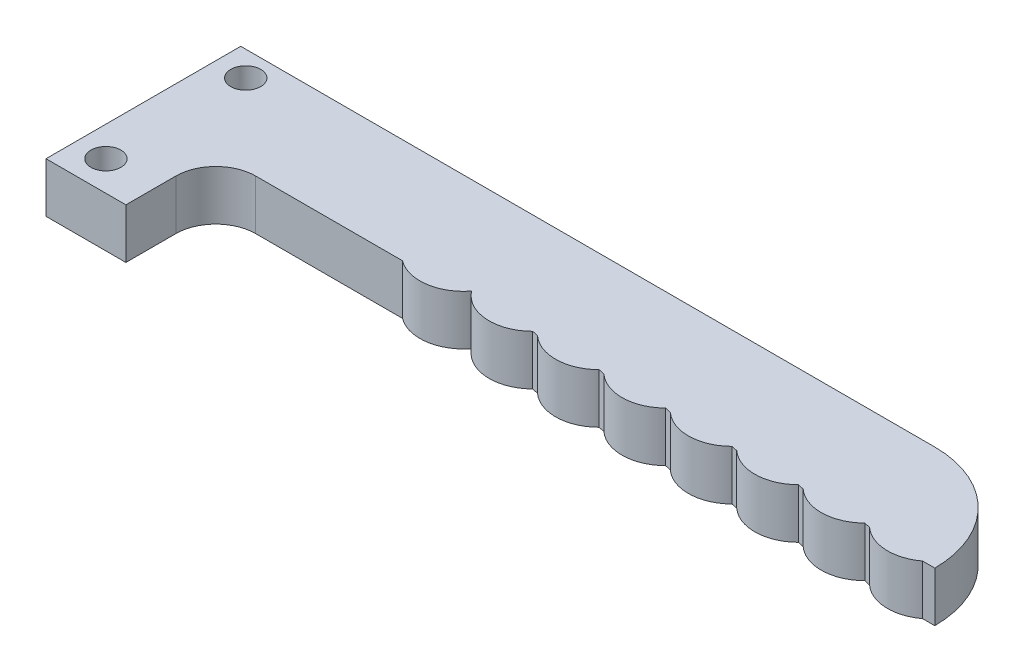
ISO-10303-21;
HEADER;
FILE_DESCRIPTION(('STEP AP214'),'2;1');
FILE_NAME('part.step','',(''),(''),'','','');
FILE_SCHEMA(('AUTOMOTIVE_DESIGN { 1 0 10303 214 1 1 1 1 }'));
ENDSEC;
DATA;
#1=APPLICATION_CONTEXT('core data for automotive mechanical design processes');
#2=APPLICATION_PROTOCOL_DEFINITION('international standard','automotive_design',2000,#1);
#3=PRODUCT_CONTEXT('',#1,'mechanical');
#4=PRODUCT('Part','Part','',(#3));
#5=PRODUCT_RELATED_PRODUCT_CATEGORY('part','',(#4));
#6=PRODUCT_DEFINITION_FORMATION('','',#4);
#7=PRODUCT_DEFINITION_CONTEXT('part definition',#1,'design');
#8=PRODUCT_DEFINITION('design','',#6,#7);
#9=PRODUCT_DEFINITION_SHAPE('','',#8);
#10=(LENGTH_UNIT() NAMED_UNIT(*) SI_UNIT(.MILLI.,.METRE.));
#11=(NAMED_UNIT(*) PLANE_ANGLE_UNIT() SI_UNIT($,.RADIAN.));
#12=(NAMED_UNIT(*) SI_UNIT($,.STERADIAN.) SOLID_ANGLE_UNIT());
#13=UNCERTAINTY_MEASURE_WITH_UNIT(LENGTH_MEASURE(1.E-05),#10,'distance_accuracy_value','');
#14=(GEOMETRIC_REPRESENTATION_CONTEXT(3) GLOBAL_UNCERTAINTY_ASSIGNED_CONTEXT((#13)) GLOBAL_UNIT_ASSIGNED_CONTEXT((#10,
#11,#12)) REPRESENTATION_CONTEXT('',''));
#15=CARTESIAN_POINT('',(0.,0.,0.));
#16=DIRECTION('',(0.,0.,1.));
#17=DIRECTION('',(1.,0.,0.));
#18=AXIS2_PLACEMENT_3D('',#15,#16,#17);
#19=CARTESIAN_POINT('',(-45.,5.,-0.875000000000003));
#20=DIRECTION('',(0.,0.,1.));
#21=DIRECTION('',(1.,0.,0.));
#22=AXIS2_PLACEMENT_3D('',#19,#20,#21);
#23=PLANE('',#22);
#24=DIRECTION('',(-1.,0.,0.));
#25=VECTOR('',#24,1.);
#26=CARTESIAN_POINT('',(-45.,5.,-0.875000000000003));
#27=LINE('',#26,#25);
#28=CARTESIAN_POINT('',(-18.3059854254778,5.,-0.874999999999996));
#29=VERTEX_POINT('',#28);
#30=CARTESIAN_POINT('',(-33.,5.,-0.875));
#31=VERTEX_POINT('',#30);
#32=EDGE_CURVE('E196',#29,#31,#27,.T.);
#33=ORIENTED_EDGE('',*,*,#32,.T.);
#34=DIRECTION('',(0.,1.,0.));
#35=VECTOR('',#34,1.);
#36=CARTESIAN_POINT('',(-33.,5.,-0.875));
#37=LINE('',#36,#35);
#38=CARTESIAN_POINT('',(-33.,0.,-0.875));
#39=VERTEX_POINT('',#38);
#40=EDGE_CURVE('E52',#31,#39,#37,.F.);
#41=ORIENTED_EDGE('',*,*,#40,.T.);
#42=DIRECTION('',(-1.,0.,0.));
#43=VECTOR('',#42,1.);
#44=CARTESIAN_POINT('',(-45.,0.,-0.875000000000003));
#45=LINE('',#44,#43);
#46=CARTESIAN_POINT('',(-18.3059854254778,0.,-0.874999999999996));
#47=VERTEX_POINT('',#46);
#48=EDGE_CURVE('E261',#47,#39,#45,.T.);
#49=ORIENTED_EDGE('',*,*,#48,.F.);
#50=DIRECTION('',(0.,-1.,0.));
#51=VECTOR('',#50,1.);
#52=CARTESIAN_POINT('',(-18.3059854254778,5.,-0.874999999999996));
#53=LINE('',#52,#51);
#54=EDGE_CURVE('E258',#29,#47,#53,.T.);
#55=ORIENTED_EDGE('',*,*,#54,.F.);
#56=EDGE_LOOP('',(#33,#41,#49,#55));
#57=FACE_BOUND('',#56,.T.);
#58=ADVANCED_FACE('F35',(#57),#23,.T.);
#59=CARTESIAN_POINT('',(-15.6809854254778,5.,-4.37500000000001));
#60=DIRECTION('',(0.,-1.,0.));
#61=DIRECTION('',(0.,0.,-1.));
#62=AXIS2_PLACEMENT_3D('',#59,#60,#61);
#63=CYLINDRICAL_SURFACE('',#62,4.37500000000001);
#64=CARTESIAN_POINT('',(-15.6809854254778,0.,-4.37500000000001));
#65=DIRECTION('',(0.,-1.,0.));
#66=DIRECTION('',(0.,0.,-1.));
#67=AXIS2_PLACEMENT_3D('',#64,#65,#66);
#68=CIRCLE('',#67,4.37500000000001);
#69=CARTESIAN_POINT('',(-12.2154927127389,0.,-1.70460953080757));
#70=VERTEX_POINT('',#69);
#71=EDGE_CURVE('E225',#70,#47,#68,.T.);
#72=ORIENTED_EDGE('',*,*,#71,.F.);
#73=DIRECTION('',(0.,-1.,0.));
#74=VECTOR('',#73,1.);
#75=CARTESIAN_POINT('',(-12.2154927127389,5.,-1.70460953080757));
#76=LINE('',#75,#74);
#77=CARTESIAN_POINT('',(-12.2154927127389,5.,-1.70460953080757));
#78=VERTEX_POINT('',#77);
#79=EDGE_CURVE('E292',#78,#70,#76,.T.);
#80=ORIENTED_EDGE('',*,*,#79,.F.);
#81=CARTESIAN_POINT('',(-15.6809854254778,5.,-4.37500000000001));
#82=DIRECTION('',(0.,-1.,0.));
#83=DIRECTION('',(0.,0.,-1.));
#84=AXIS2_PLACEMENT_3D('',#81,#82,#83);
#85=CIRCLE('',#84,4.37500000000001);
#86=EDGE_CURVE('E226',#78,#29,#85,.T.);
#87=ORIENTED_EDGE('',*,*,#86,.T.);
#88=ORIENTED_EDGE('',*,*,#54,.T.);
#89=EDGE_LOOP('',(#72,#80,#87,#88));
#90=FACE_BOUND('',#89,.T.);
#91=ADVANCED_FACE('F389',(#90),#63,.T.);
#92=CARTESIAN_POINT('',(-8.75000000000001,5.,-4.37500000000001));
#93=DIRECTION('',(0.,-1.,0.));
#94=DIRECTION('',(0.,0.,-1.));
#95=AXIS2_PLACEMENT_3D('',#92,#93,#94);
#96=CYLINDRICAL_SURFACE('',#95,4.375);
#97=CARTESIAN_POINT('',(-8.75000000000001,0.,-4.37500000000001));
#98=DIRECTION('',(0.,-1.,0.));
#99=DIRECTION('',(0.,0.,-1.));
#100=AXIS2_PLACEMENT_3D('',#97,#98,#99);
#101=CIRCLE('',#100,4.375);
#102=CARTESIAN_POINT('',(-5.66092195289418,0.,-1.27690028906608));
#103=VERTEX_POINT('',#102);
#104=EDGE_CURVE('E229',#103,#70,#101,.T.);
#105=ORIENTED_EDGE('',*,*,#104,.F.);
#106=DIRECTION('',(0.,-1.,0.));
#107=VECTOR('',#106,1.);
#108=CARTESIAN_POINT('',(-5.66092195289418,5.,-1.27690028906608));
#109=LINE('',#108,#107);
#110=CARTESIAN_POINT('',(-5.66092195289418,5.,-1.27690028906608));
#111=VERTEX_POINT('',#110);
#112=EDGE_CURVE('E332',#103,#111,#109,.F.);
#113=ORIENTED_EDGE('',*,*,#112,.T.);
#114=CARTESIAN_POINT('',(-8.75000000000001,5.,-4.37500000000001));
#115=DIRECTION('',(0.,-1.,0.));
#116=DIRECTION('',(0.,0.,-1.));
#117=AXIS2_PLACEMENT_3D('',#114,#115,#116);
#118=CIRCLE('',#117,4.375);
#119=EDGE_CURVE('E256',#111,#78,#118,.T.);
#120=ORIENTED_EDGE('',*,*,#119,.T.);
#121=ORIENTED_EDGE('',*,*,#79,.T.);
#122=EDGE_LOOP('',(#105,#113,#120,#121));
#123=FACE_BOUND('',#122,.T.);
#124=ADVANCED_FACE('F394',(#123),#96,.T.);
#125=CARTESIAN_POINT('',(-2.10000000000001,5.,-4.37500000000001));
#126=DIRECTION('',(0.,-1.,0.));
#127=DIRECTION('',(0.,0.,-1.));
#128=AXIS2_PLACEMENT_3D('',#125,#126,#127);
#129=CYLINDRICAL_SURFACE('',#128,4.37500000000001);
#130=CARTESIAN_POINT('',(-2.10000000000001,0.,-4.37500000000001));
#131=DIRECTION('',(0.,-1.,0.));
#132=DIRECTION('',(0.,0.,-1.));
#133=AXIS2_PLACEMENT_3D('',#130,#131,#132);
#134=CIRCLE('',#133,4.37500000000001);
#135=CARTESIAN_POINT('',(0.989078047105822,0.,-1.27690028906608));
#136=VERTEX_POINT('',#135);
#137=CARTESIAN_POINT('',(-5.0445002260906,0.,-1.13917809226891));
#138=VERTEX_POINT('',#137);
#139=EDGE_CURVE('E288',#136,#138,#134,.T.);
#140=ORIENTED_EDGE('',*,*,#139,.F.);
#141=DIRECTION('',(0.,-1.,0.));
#142=VECTOR('',#141,1.);
#143=CARTESIAN_POINT('',(0.989078047105822,5.,-1.27690028906608));
#144=LINE('',#143,#142);
#145=CARTESIAN_POINT('',(0.989078047105822,5.,-1.27690028906608));
#146=VERTEX_POINT('',#145);
#147=EDGE_CURVE('E322',#136,#146,#144,.F.);
#148=ORIENTED_EDGE('',*,*,#147,.T.);
#149=CARTESIAN_POINT('',(-2.10000000000001,5.,-4.37500000000001));
#150=DIRECTION('',(0.,-1.,0.));
#151=DIRECTION('',(0.,0.,-1.));
#152=AXIS2_PLACEMENT_3D('',#149,#150,#151);
#153=CIRCLE('',#152,4.37500000000001);
#154=CARTESIAN_POINT('',(-5.0445002260906,5.,-1.13917809226891));
#155=VERTEX_POINT('',#154);
#156=EDGE_CURVE('E253',#146,#155,#153,.T.);
#157=ORIENTED_EDGE('',*,*,#156,.T.);
#158=DIRECTION('',(0.,-1.,0.));
#159=VECTOR('',#158,1.);
#160=CARTESIAN_POINT('',(-5.0445002260906,5.,-1.13917809226891));
#161=LINE('',#160,#159);
#162=EDGE_CURVE('E319',#155,#138,#161,.T.);
#163=ORIENTED_EDGE('',*,*,#162,.T.);
#164=EDGE_LOOP('',(#140,#148,#157,#163));
#165=FACE_BOUND('',#164,.T.);
#166=ADVANCED_FACE('F608',(#165),#129,.T.);
#167=CARTESIAN_POINT('',(4.54999999999999,5.,-4.37500000000001));
#168=DIRECTION('',(0.,-1.,0.));
#169=DIRECTION('',(0.,0.,-1.));
#170=AXIS2_PLACEMENT_3D('',#167,#168,#169);
#171=CYLINDRICAL_SURFACE('',#170,4.37500000000001);
#172=CARTESIAN_POINT('',(4.54999999999999,5.,-4.37500000000001));
#173=DIRECTION('',(0.,-1.,0.));
#174=DIRECTION('',(0.,0.,-1.));
#175=AXIS2_PLACEMENT_3D('',#172,#173,#174);
#176=CIRCLE('',#175,4.37500000000001);
#177=CARTESIAN_POINT('',(7.63907804710582,5.,-1.27690028906608));
#178=VERTEX_POINT('',#177);
#179=CARTESIAN_POINT('',(1.6054997739094,5.,-1.13917809226891));
#180=VERTEX_POINT('',#179);
#181=EDGE_CURVE('E250',#178,#180,#176,.T.);
#182=ORIENTED_EDGE('',*,*,#181,.T.);
#183=DIRECTION('',(0.,-1.,0.));
#184=VECTOR('',#183,1.);
#185=CARTESIAN_POINT('',(1.6054997739094,5.,-1.13917809226891));
#186=LINE('',#185,#184);
#187=CARTESIAN_POINT('',(1.6054997739094,0.,-1.13917809226891));
#188=VERTEX_POINT('',#187);
#189=EDGE_CURVE('E316',#180,#188,#186,.T.);
#190=ORIENTED_EDGE('',*,*,#189,.T.);
#191=CARTESIAN_POINT('',(4.54999999999999,0.,-4.37500000000001));
#192=DIRECTION('',(0.,-1.,0.));
#193=DIRECTION('',(0.,0.,-1.));
#194=AXIS2_PLACEMENT_3D('',#191,#192,#193);
#195=CIRCLE('',#194,4.37500000000001);
#196=CARTESIAN_POINT('',(7.63907804710582,0.,-1.27690028906608));
#197=VERTEX_POINT('',#196);
#198=EDGE_CURVE('E285',#197,#188,#195,.T.);
#199=ORIENTED_EDGE('',*,*,#198,.F.);
#200=DIRECTION('',(0.,-1.,0.));
#201=VECTOR('',#200,1.);
#202=CARTESIAN_POINT('',(7.63907804710582,5.,-1.27690028906608));
#203=LINE('',#202,#201);
#204=EDGE_CURVE('E314',#197,#178,#203,.F.);
#205=ORIENTED_EDGE('',*,*,#204,.T.);
#206=EDGE_LOOP('',(#182,#190,#199,#205));
#207=FACE_BOUND('',#206,.T.);
#208=ADVANCED_FACE('F615',(#207),#171,.T.);
#209=CARTESIAN_POINT('',(11.2,5.,-4.37500000000001));
#210=DIRECTION('',(0.,-1.,0.));
#211=DIRECTION('',(0.,0.,-1.));
#212=AXIS2_PLACEMENT_3D('',#209,#210,#211);
#213=CYLINDRICAL_SURFACE('',#212,4.37500000000001);
#214=CARTESIAN_POINT('',(11.2,5.,-4.37500000000001));
#215=DIRECTION('',(0.,-1.,0.));
#216=DIRECTION('',(0.,0.,-1.));
#217=AXIS2_PLACEMENT_3D('',#214,#215,#216);
#218=CIRCLE('',#217,4.37500000000001);
#219=CARTESIAN_POINT('',(14.2890780471058,5.,-1.27690028906607));
#220=VERTEX_POINT('',#219);
#221=CARTESIAN_POINT('',(8.25549977390939,5.,-1.13917809226892));
#222=VERTEX_POINT('',#221);
#223=EDGE_CURVE('E247',#220,#222,#218,.T.);
#224=ORIENTED_EDGE('',*,*,#223,.T.);
#225=DIRECTION('',(0.,-1.,0.));
#226=VECTOR('',#225,1.);
#227=CARTESIAN_POINT('',(8.25549977390939,5.,-1.13917809226892));
#228=LINE('',#227,#226);
#229=CARTESIAN_POINT('',(8.25549977390939,0.,-1.13917809226892));
#230=VERTEX_POINT('',#229);
#231=EDGE_CURVE('E329',#222,#230,#228,.T.);
#232=ORIENTED_EDGE('',*,*,#231,.T.);
#233=CARTESIAN_POINT('',(11.2,0.,-4.37500000000001));
#234=DIRECTION('',(0.,-1.,0.));
#235=DIRECTION('',(0.,0.,-1.));
#236=AXIS2_PLACEMENT_3D('',#233,#234,#235);
#237=CIRCLE('',#236,4.37500000000001);
#238=CARTESIAN_POINT('',(14.2890780471058,0.,-1.27690028906607));
#239=VERTEX_POINT('',#238);
#240=EDGE_CURVE('E282',#239,#230,#237,.T.);
#241=ORIENTED_EDGE('',*,*,#240,.F.);
#242=DIRECTION('',(0.,-1.,0.));
#243=VECTOR('',#242,1.);
#244=CARTESIAN_POINT('',(14.2890780471058,5.,-1.27690028906607));
#245=LINE('',#244,#243);
#246=EDGE_CURVE('E327',#239,#220,#245,.F.);
#247=ORIENTED_EDGE('',*,*,#246,.T.);
#248=EDGE_LOOP('',(#224,#232,#241,#247));
#249=FACE_BOUND('',#248,.T.);
#250=ADVANCED_FACE('F623',(#249),#213,.T.);
#251=CARTESIAN_POINT('',(17.85,5.,-4.37500000000001));
#252=DIRECTION('',(0.,-1.,0.));
#253=DIRECTION('',(0.,0.,-1.));
#254=AXIS2_PLACEMENT_3D('',#251,#252,#253);
#255=CYLINDRICAL_SURFACE('',#254,4.37500000000001);
#256=CARTESIAN_POINT('',(17.85,0.,-4.37500000000001));
#257=DIRECTION('',(0.,-1.,0.));
#258=DIRECTION('',(0.,0.,-1.));
#259=AXIS2_PLACEMENT_3D('',#256,#257,#258);
#260=CIRCLE('',#259,4.37500000000001);
#261=CARTESIAN_POINT('',(20.9390780471058,0.,-1.27690028906607));
#262=VERTEX_POINT('',#261);
#263=CARTESIAN_POINT('',(14.9054997739094,0.,-1.13917809226891));
#264=VERTEX_POINT('',#263);
#265=EDGE_CURVE('E279',#262,#264,#260,.T.);
#266=ORIENTED_EDGE('',*,*,#265,.F.);
#267=DIRECTION('',(0.,-1.,0.));
#268=VECTOR('',#267,1.);
#269=CARTESIAN_POINT('',(20.9390780471058,5.,-1.27690028906607));
#270=LINE('',#269,#268);
#271=CARTESIAN_POINT('',(20.9390780471058,5.,-1.27690028906607));
#272=VERTEX_POINT('',#271);
#273=EDGE_CURVE('E312',#262,#272,#270,.F.);
#274=ORIENTED_EDGE('',*,*,#273,.T.);
#275=CARTESIAN_POINT('',(17.85,5.,-4.37500000000001));
#276=DIRECTION('',(0.,-1.,0.));
#277=DIRECTION('',(0.,0.,-1.));
#278=AXIS2_PLACEMENT_3D('',#275,#276,#277);
#279=CIRCLE('',#278,4.37500000000001);
#280=CARTESIAN_POINT('',(14.9054997739094,5.,-1.13917809226891));
#281=VERTEX_POINT('',#280);
#282=EDGE_CURVE('E244',#272,#281,#279,.T.);
#283=ORIENTED_EDGE('',*,*,#282,.T.);
#284=DIRECTION('',(0.,-1.,0.));
#285=VECTOR('',#284,1.);
#286=CARTESIAN_POINT('',(14.9054997739094,5.,-1.13917809226891));
#287=LINE('',#286,#285);
#288=EDGE_CURVE('E309',#281,#264,#287,.T.);
#289=ORIENTED_EDGE('',*,*,#288,.T.);
#290=EDGE_LOOP('',(#266,#274,#283,#289));
#291=FACE_BOUND('',#290,.T.);
#292=ADVANCED_FACE('F451',(#291),#255,.T.);
#293=CARTESIAN_POINT('',(24.5,5.,-4.37500000000001));
#294=DIRECTION('',(0.,-1.,0.));
#295=DIRECTION('',(0.,0.,-1.));
#296=AXIS2_PLACEMENT_3D('',#293,#294,#295);
#297=CYLINDRICAL_SURFACE('',#296,4.37500000000001);
#298=CARTESIAN_POINT('',(24.5,5.,-4.37500000000001));
#299=DIRECTION('',(0.,-1.,0.));
#300=DIRECTION('',(0.,0.,-1.));
#301=AXIS2_PLACEMENT_3D('',#298,#299,#300);
#302=CIRCLE('',#301,4.37500000000001);
#303=CARTESIAN_POINT('',(27.5890780471058,5.,-1.27690028906607));
#304=VERTEX_POINT('',#303);
#305=CARTESIAN_POINT('',(21.5554997739094,5.,-1.1391780922689));
#306=VERTEX_POINT('',#305);
#307=EDGE_CURVE('E241',#304,#306,#302,.T.);
#308=ORIENTED_EDGE('',*,*,#307,.T.);
#309=DIRECTION('',(0.,-1.,0.));
#310=VECTOR('',#309,1.);
#311=CARTESIAN_POINT('',(21.5554997739094,5.,-1.1391780922689));
#312=LINE('',#311,#310);
#313=CARTESIAN_POINT('',(21.5554997739094,0.,-1.1391780922689));
#314=VERTEX_POINT('',#313);
#315=EDGE_CURVE('E306',#306,#314,#312,.T.);
#316=ORIENTED_EDGE('',*,*,#315,.T.);
#317=CARTESIAN_POINT('',(24.5,0.,-4.37500000000001));
#318=DIRECTION('',(0.,-1.,0.));
#319=DIRECTION('',(0.,0.,-1.));
#320=AXIS2_PLACEMENT_3D('',#317,#318,#319);
#321=CIRCLE('',#320,4.37500000000001);
#322=CARTESIAN_POINT('',(27.5890780471058,0.,-1.27690028906607));
#323=VERTEX_POINT('',#322);
#324=EDGE_CURVE('E276',#323,#314,#321,.T.);
#325=ORIENTED_EDGE('',*,*,#324,.F.);
#326=DIRECTION('',(0.,-1.,0.));
#327=VECTOR('',#326,1.);
#328=CARTESIAN_POINT('',(27.5890780471058,5.,-1.27690028906607));
#329=LINE('',#328,#327);
#330=EDGE_CURVE('E295',#323,#304,#329,.F.);
#331=ORIENTED_EDGE('',*,*,#330,.T.);
#332=EDGE_LOOP('',(#308,#316,#325,#331));
#333=FACE_BOUND('',#332,.T.);
#334=ADVANCED_FACE('F457',(#333),#297,.T.);
#335=CARTESIAN_POINT('',(31.15,5.,-4.37500000000001));
#336=DIRECTION('',(0.,-1.,0.));
#337=DIRECTION('',(0.,0.,-1.));
#338=AXIS2_PLACEMENT_3D('',#335,#336,#337);
#339=CYLINDRICAL_SURFACE('',#338,4.375);
#340=CARTESIAN_POINT('',(31.15,5.,-4.37500000000001));
#341=DIRECTION('',(0.,-1.,0.));
#342=DIRECTION('',(0.,0.,-1.));
#343=AXIS2_PLACEMENT_3D('',#340,#341,#342);
#344=CIRCLE('',#343,4.375);
#345=CARTESIAN_POINT('',(33.775,5.,-0.875000000000004));
#346=VERTEX_POINT('',#345);
#347=CARTESIAN_POINT('',(28.2054997739094,5.,-1.13917809226891));
#348=VERTEX_POINT('',#347);
#349=EDGE_CURVE('E238',#346,#348,#344,.T.);
#350=ORIENTED_EDGE('',*,*,#349,.T.);
#351=DIRECTION('',(0.,-1.,0.));
#352=VECTOR('',#351,1.);
#353=CARTESIAN_POINT('',(28.2054997739094,5.,-1.13917809226891));
#354=LINE('',#353,#352);
#355=CARTESIAN_POINT('',(28.2054997739094,0.,-1.13917809226891));
#356=VERTEX_POINT('',#355);
#357=EDGE_CURVE('E324',#348,#356,#354,.T.);
#358=ORIENTED_EDGE('',*,*,#357,.T.);
#359=CARTESIAN_POINT('',(31.15,0.,-4.37500000000001));
#360=DIRECTION('',(0.,-1.,0.));
#361=DIRECTION('',(0.,0.,-1.));
#362=AXIS2_PLACEMENT_3D('',#359,#360,#361);
#363=CIRCLE('',#362,4.375);
#364=CARTESIAN_POINT('',(33.775,0.,-0.875000000000004));
#365=VERTEX_POINT('',#364);
#366=EDGE_CURVE('E273',#365,#356,#363,.T.);
#367=ORIENTED_EDGE('',*,*,#366,.F.);
#368=DIRECTION('',(0.,-1.,0.));
#369=VECTOR('',#368,1.);
#370=CARTESIAN_POINT('',(33.775,5.,-0.875000000000004));
#371=LINE('',#370,#369);
#372=EDGE_CURVE('E296',#346,#365,#371,.T.);
#373=ORIENTED_EDGE('',*,*,#372,.F.);
#374=EDGE_LOOP('',(#350,#358,#367,#373));
#375=FACE_BOUND('',#374,.T.);
#376=ADVANCED_FACE('F464',(#375),#339,.T.);
#377=CARTESIAN_POINT('',(35.,5.,-0.875000000000005));
#378=DIRECTION('',(0.,0.,1.));
#379=DIRECTION('',(1.,0.,0.));
#380=AXIS2_PLACEMENT_3D('',#377,#378,#379);
#381=PLANE('',#380);
#382=DIRECTION('',(-1.,0.,0.));
#383=VECTOR('',#382,1.);
#384=CARTESIAN_POINT('',(35.,0.,-0.875000000000005));
#385=LINE('',#384,#383);
#386=CARTESIAN_POINT('',(35.,0.,-0.875000000000005));
#387=VERTEX_POINT('',#386);
#388=EDGE_CURVE('E270',#387,#365,#385,.T.);
#389=ORIENTED_EDGE('',*,*,#388,.F.);
#390=DIRECTION('',(0.,-1.,0.));
#391=VECTOR('',#390,1.);
#392=CARTESIAN_POINT('',(35.,5.,-0.875000000000005));
#393=LINE('',#392,#391);
#394=CARTESIAN_POINT('',(35.,5.,-0.875000000000005));
#395=VERTEX_POINT('',#394);
#396=EDGE_CURVE('E298',#395,#387,#393,.T.);
#397=ORIENTED_EDGE('',*,*,#396,.F.);
#398=DIRECTION('',(-1.,0.,0.));
#399=VECTOR('',#398,1.);
#400=CARTESIAN_POINT('',(35.,5.,-0.875000000000005));
#401=LINE('',#400,#399);
#402=EDGE_CURVE('E235',#395,#346,#401,.T.);
#403=ORIENTED_EDGE('',*,*,#402,.T.);
#404=ORIENTED_EDGE('',*,*,#372,.T.);
#405=EDGE_LOOP('',(#389,#397,#403,#404));
#406=FACE_BOUND('',#405,.T.);
#407=ADVANCED_FACE('F468',(#406),#381,.T.);
#408=CARTESIAN_POINT('',(24.5,5.,-0.875000000000003));
#409=DIRECTION('',(0.,-1.,0.));
#410=DIRECTION('',(0.,0.,-1.));
#411=AXIS2_PLACEMENT_3D('',#408,#409,#410);
#412=CYLINDRICAL_SURFACE('',#411,10.5);
#413=CARTESIAN_POINT('',(24.5,0.,-0.875000000000003));
#414=DIRECTION('',(0.,-1.,0.));
#415=DIRECTION('',(0.,0.,-1.));
#416=AXIS2_PLACEMENT_3D('',#413,#414,#415);
#417=CIRCLE('',#416,10.5);
#418=CARTESIAN_POINT('',(24.5,0.,-11.375));
#419=VERTEX_POINT('',#418);
#420=EDGE_CURVE('E267',#419,#387,#417,.T.);
#421=ORIENTED_EDGE('',*,*,#420,.F.);
#422=DIRECTION('',(0.,-1.,0.));
#423=VECTOR('',#422,1.);
#424=CARTESIAN_POINT('',(24.5,5.,-11.375));
#425=LINE('',#424,#423);
#426=CARTESIAN_POINT('',(24.5,5.,-11.375));
#427=VERTEX_POINT('',#426);
#428=EDGE_CURVE('E300',#427,#419,#425,.T.);
#429=ORIENTED_EDGE('',*,*,#428,.F.);
#430=CARTESIAN_POINT('',(24.5,5.,-0.875000000000003));
#431=DIRECTION('',(0.,-1.,0.));
#432=DIRECTION('',(0.,0.,-1.));
#433=AXIS2_PLACEMENT_3D('',#430,#431,#432);
#434=CIRCLE('',#433,10.5);
#435=EDGE_CURVE('E232',#427,#395,#434,.T.);
#436=ORIENTED_EDGE('',*,*,#435,.T.);
#437=ORIENTED_EDGE('',*,*,#396,.T.);
#438=EDGE_LOOP('',(#421,#429,#436,#437));
#439=FACE_BOUND('',#438,.T.);
#440=ADVANCED_FACE('F471',(#439),#412,.T.);
#441=CARTESIAN_POINT('',(-45.,5.,-11.375));
#442=DIRECTION('',(0.,0.,-1.));
#443=DIRECTION('',(-1.,0.,0.));
#444=AXIS2_PLACEMENT_3D('',#441,#442,#443);
#445=PLANE('',#444);
#446=DIRECTION('',(1.,0.,0.));
#447=VECTOR('',#446,1.);
#448=CARTESIAN_POINT('',(-45.,0.,-11.375));
#449=LINE('',#448,#447);
#450=CARTESIAN_POINT('',(-45.,0.,-11.375));
#451=VERTEX_POINT('',#450);
#452=EDGE_CURVE('E264',#451,#419,#449,.T.);
#453=ORIENTED_EDGE('',*,*,#452,.F.);
#454=DIRECTION('',(0.,-1.,0.));
#455=VECTOR('',#454,1.);
#456=CARTESIAN_POINT('',(-45.,5.,-11.375));
#457=LINE('',#456,#455);
#458=CARTESIAN_POINT('',(-45.,5.,-11.375));
#459=VERTEX_POINT('',#458);
#460=EDGE_CURVE('E302',#459,#451,#457,.T.);
#461=ORIENTED_EDGE('',*,*,#460,.F.);
#462=DIRECTION('',(1.,0.,0.));
#463=VECTOR('',#462,1.);
#464=CARTESIAN_POINT('',(-45.,5.,-11.375));
#465=LINE('',#464,#463);
#466=EDGE_CURVE('E194',#459,#427,#465,.T.);
#467=ORIENTED_EDGE('',*,*,#466,.T.);
#468=ORIENTED_EDGE('',*,*,#428,.T.);
#469=EDGE_LOOP('',(#453,#461,#467,#468));
#470=FACE_BOUND('',#469,.T.);
#471=ADVANCED_FACE('F385',(#470),#445,.T.);
#472=CARTESIAN_POINT('',(-45.,5.,-0.875000000000003));
#473=DIRECTION('',(-1.,0.,0.));
#474=DIRECTION('',(0.,0.,1.));
#475=AXIS2_PLACEMENT_3D('',#472,#473,#474);
#476=PLANE('',#475);
#477=DIRECTION('',(0.,0.,-1.));
#478=VECTOR('',#477,1.);
#479=CARTESIAN_POINT('',(-45.,0.,-0.875000000000003));
#480=LINE('',#479,#478);
#481=CARTESIAN_POINT('',(-45.,0.,8.12500000000001));
#482=VERTEX_POINT('',#481);
#483=EDGE_CURVE('E202',#482,#451,#480,.T.);
#484=ORIENTED_EDGE('',*,*,#483,.F.);
#485=DIRECTION('',(0.,-1.,0.));
#486=VECTOR('',#485,1.);
#487=CARTESIAN_POINT('',(-45.,0.,8.12500000000001));
#488=LINE('',#487,#486);
#489=CARTESIAN_POINT('',(-45.,5.,8.12500000000001));
#490=VERTEX_POINT('',#489);
#491=EDGE_CURVE('E199',#490,#482,#488,.T.);
#492=ORIENTED_EDGE('',*,*,#491,.F.);
#493=DIRECTION('',(0.,0.,-1.));
#494=VECTOR('',#493,1.);
#495=CARTESIAN_POINT('',(-45.,5.,-0.875000000000003));
#496=LINE('',#495,#494);
#497=EDGE_CURVE('E186',#490,#459,#496,.T.);
#498=ORIENTED_EDGE('',*,*,#497,.T.);
#499=ORIENTED_EDGE('',*,*,#460,.T.);
#500=EDGE_LOOP('',(#484,#492,#498,#499));
#501=FACE_BOUND('',#500,.T.);
#502=ADVANCED_FACE('F200',(#501),#476,.T.);
#503=CARTESIAN_POINT('',(-15.6809854254778,5.,-4.37500000000001));
#504=DIRECTION('',(0.,-1.,0.));
#505=DIRECTION('',(0.,0.,-1.));
#506=AXIS2_PLACEMENT_3D('',#503,#504,#505);
#507=PLANE('',#506);
#508=CARTESIAN_POINT('',(-42.,5.,5.125));
#509=DIRECTION('',(0.,1.,0.));
#510=DIRECTION('',(0.,0.,1.));
#511=AXIS2_PLACEMENT_3D('',#508,#509,#510);
#512=CIRCLE('',#511,1.5);
#513=CARTESIAN_POINT('',(-42.,5.,6.62500000000001));
#514=VERTEX_POINT('',#513);
#515=EDGE_CURVE('E363',#514,#514,#512,.T.);
#516=ORIENTED_EDGE('',*,*,#515,.F.);
#517=EDGE_LOOP('',(#516));
#518=FACE_BOUND('',#517,.T.);
#519=CARTESIAN_POINT('',(-42.,5.,-8.875));
#520=DIRECTION('',(0.,1.,0.));
#521=DIRECTION('',(0.,0.,1.));
#522=AXIS2_PLACEMENT_3D('',#519,#520,#521);
#523=CIRCLE('',#522,1.5);
#524=CARTESIAN_POINT('',(-42.,5.,-7.37499999999999));
#525=VERTEX_POINT('',#524);
#526=EDGE_CURVE('E215',#525,#525,#523,.T.);
#527=ORIENTED_EDGE('',*,*,#526,.F.);
#528=EDGE_LOOP('',(#527));
#529=FACE_BOUND('',#528,.T.);
#530=ORIENTED_EDGE('',*,*,#86,.F.);
#531=ORIENTED_EDGE('',*,*,#119,.F.);
#532=DIRECTION('',(-0.975938457896702,0.,-0.218046156577472));
#533=VECTOR('',#532,1.);
#534=CARTESIAN_POINT('',(-15.863864732791,5.,-3.55646253086048));
#535=LINE('',#534,#533);
#536=EDGE_CURVE('E352',#111,#155,#535,.F.);
#537=ORIENTED_EDGE('',*,*,#536,.T.);
#538=ORIENTED_EDGE('',*,*,#156,.F.);
#539=DIRECTION('',(-0.975938457896701,0.,-0.218046156577477));
#540=VECTOR('',#539,1.);
#541=CARTESIAN_POINT('',(-15.5476962922429,5.,-4.97158006903403));
#542=LINE('',#541,#540);
#543=EDGE_CURVE('E340',#146,#180,#542,.F.);
#544=ORIENTED_EDGE('',*,*,#543,.T.);
#545=ORIENTED_EDGE('',*,*,#181,.F.);
#546=DIRECTION('',(-0.975938457896703,0.,-0.218046156577466));
#547=VECTOR('',#546,1.);
#548=CARTESIAN_POINT('',(-15.2315278516949,5.,-6.38669760720726));
#549=LINE('',#548,#547);
#550=EDGE_CURVE('E348',#178,#222,#549,.F.);
#551=ORIENTED_EDGE('',*,*,#550,.T.);
#552=ORIENTED_EDGE('',*,*,#223,.F.);
#553=DIRECTION('',(-0.975938457896703,0.,-0.218046156577469));
#554=VECTOR('',#553,1.);
#555=CARTESIAN_POINT('',(-14.9153594111468,5.,-7.80181514538076));
#556=LINE('',#555,#554);
#557=EDGE_CURVE('E356',#220,#281,#556,.F.);
#558=ORIENTED_EDGE('',*,*,#557,.T.);
#559=ORIENTED_EDGE('',*,*,#282,.F.);
#560=DIRECTION('',(-0.975938457896701,0.,-0.218046156577477));
#561=VECTOR('',#560,1.);
#562=CARTESIAN_POINT('',(-14.5991909705986,5.,-9.2169326835545));
#563=LINE('',#562,#561);
#564=EDGE_CURVE('E336',#272,#306,#563,.F.);
#565=ORIENTED_EDGE('',*,*,#564,.T.);
#566=ORIENTED_EDGE('',*,*,#307,.F.);
#567=DIRECTION('',(-0.975938457896704,0.,-0.218046156577465));
#568=VECTOR('',#567,1.);
#569=CARTESIAN_POINT('',(-14.2830225300507,5.,-10.6320502217275));
#570=LINE('',#569,#568);
#571=EDGE_CURVE('E344',#304,#348,#570,.F.);
#572=ORIENTED_EDGE('',*,*,#571,.T.);
#573=ORIENTED_EDGE('',*,*,#349,.F.);
#574=ORIENTED_EDGE('',*,*,#402,.F.);
#575=ORIENTED_EDGE('',*,*,#435,.F.);
#576=ORIENTED_EDGE('',*,*,#466,.F.);
#577=ORIENTED_EDGE('',*,*,#497,.F.);
#578=DIRECTION('',(-1.,0.,0.));
#579=VECTOR('',#578,1.);
#580=CARTESIAN_POINT('',(-45.,5.,8.12500000000001));
#581=LINE('',#580,#579);
#582=CARTESIAN_POINT('',(-37.,5.,8.12500000000001));
#583=VERTEX_POINT('',#582);
#584=EDGE_CURVE('E191',#583,#490,#581,.T.);
#585=ORIENTED_EDGE('',*,*,#584,.F.);
#586=DIRECTION('',(0.,0.,-1.));
#587=VECTOR('',#586,1.);
#588=CARTESIAN_POINT('',(-37.,5.,8.12500000000001));
#589=LINE('',#588,#587);
#590=CARTESIAN_POINT('',(-37.,5.,3.125));
#591=VERTEX_POINT('',#590);
#592=EDGE_CURVE('E220',#583,#591,#589,.T.);
#593=ORIENTED_EDGE('',*,*,#592,.T.);
#594=CARTESIAN_POINT('',(-33.,5.,3.125));
#595=DIRECTION('',(0.,-1.,0.));
#596=DIRECTION('',(0.,0.,-1.));
#597=AXIS2_PLACEMENT_3D('',#594,#595,#596);
#598=CIRCLE('',#597,4.);
#599=EDGE_CURVE('E44',#591,#31,#598,.T.);
#600=ORIENTED_EDGE('',*,*,#599,.T.);
#601=ORIENTED_EDGE('',*,*,#32,.F.);
#602=EDGE_LOOP('',(#530,#531,#537,#538,#544,#545,#551,#552,#558,#559,#565,#566,#572,#573,#574,
#575,#576,#577,#585,#593,#600,#601));
#603=FACE_BOUND('',#602,.T.);
#604=ADVANCED_FACE('F189',(#518,#529,#603),#507,.F.);
#605=CARTESIAN_POINT('',(-15.6809854254778,0.,-4.37500000000001));
#606=DIRECTION('',(0.,-1.,0.));
#607=DIRECTION('',(0.,0.,-1.));
#608=AXIS2_PLACEMENT_3D('',#605,#606,#607);
#609=PLANE('',#608);
#610=CARTESIAN_POINT('',(-42.,0.,5.125));
#611=DIRECTION('',(0.,-1.,0.));
#612=DIRECTION('',(0.,0.,-1.));
#613=AXIS2_PLACEMENT_3D('',#610,#611,#612);
#614=CIRCLE('',#613,1.5);
#615=CARTESIAN_POINT('',(-42.,0.,3.625));
#616=VERTEX_POINT('',#615);
#617=EDGE_CURVE('E39',#616,#616,#614,.T.);
#618=ORIENTED_EDGE('',*,*,#617,.F.);
#619=EDGE_LOOP('',(#618));
#620=FACE_BOUND('',#619,.T.);
#621=CARTESIAN_POINT('',(-42.,0.,-8.875));
#622=DIRECTION('',(0.,-1.,0.));
#623=DIRECTION('',(0.,0.,-1.));
#624=AXIS2_PLACEMENT_3D('',#621,#622,#623);
#625=CIRCLE('',#624,1.5);
#626=CARTESIAN_POINT('',(-42.,0.,-10.375));
#627=VERTEX_POINT('',#626);
#628=EDGE_CURVE('E213',#627,#627,#625,.T.);
#629=ORIENTED_EDGE('',*,*,#628,.F.);
#630=EDGE_LOOP('',(#629));
#631=FACE_BOUND('',#630,.T.);
#632=ORIENTED_EDGE('',*,*,#71,.T.);
#633=ORIENTED_EDGE('',*,*,#48,.T.);
#634=CARTESIAN_POINT('',(-33.,0.,3.125));
#635=DIRECTION('',(0.,-1.,0.));
#636=DIRECTION('',(0.,0.,-1.));
#637=AXIS2_PLACEMENT_3D('',#634,#635,#636);
#638=CIRCLE('',#637,4.);
#639=CARTESIAN_POINT('',(-37.,0.,3.125));
#640=VERTEX_POINT('',#639);
#641=EDGE_CURVE('E11',#39,#640,#638,.F.);
#642=ORIENTED_EDGE('',*,*,#641,.T.);
#643=DIRECTION('',(0.,0.,-1.));
#644=VECTOR('',#643,1.);
#645=CARTESIAN_POINT('',(-37.,0.,8.12500000000001));
#646=LINE('',#645,#644);
#647=CARTESIAN_POINT('',(-37.,0.,8.12500000000001));
#648=VERTEX_POINT('',#647);
#649=EDGE_CURVE('E222',#648,#640,#646,.T.);
#650=ORIENTED_EDGE('',*,*,#649,.F.);
#651=DIRECTION('',(1.,0.,0.));
#652=VECTOR('',#651,1.);
#653=CARTESIAN_POINT('',(-37.,0.,8.12500000000001));
#654=LINE('',#653,#652);
#655=EDGE_CURVE('E205',#482,#648,#654,.T.);
#656=ORIENTED_EDGE('',*,*,#655,.F.);
#657=ORIENTED_EDGE('',*,*,#483,.T.);
#658=ORIENTED_EDGE('',*,*,#452,.T.);
#659=ORIENTED_EDGE('',*,*,#420,.T.);
#660=ORIENTED_EDGE('',*,*,#388,.T.);
#661=ORIENTED_EDGE('',*,*,#366,.T.);
#662=DIRECTION('',(0.975938457896704,0.,0.218046156577465));
#663=VECTOR('',#662,1.);
#664=CARTESIAN_POINT('',(28.2054997739094,0.,-1.13917809226891));
#665=LINE('',#664,#663);
#666=EDGE_CURVE('E342',#356,#323,#665,.F.);
#667=ORIENTED_EDGE('',*,*,#666,.T.);
#668=ORIENTED_EDGE('',*,*,#324,.T.);
#669=DIRECTION('',(0.975938457896701,0.,0.218046156577477));
#670=VECTOR('',#669,1.);
#671=CARTESIAN_POINT('',(21.5554997739094,0.,-1.1391780922689));
#672=LINE('',#671,#670);
#673=EDGE_CURVE('E334',#314,#262,#672,.F.);
#674=ORIENTED_EDGE('',*,*,#673,.T.);
#675=ORIENTED_EDGE('',*,*,#265,.T.);
#676=DIRECTION('',(0.975938457896703,0.,0.218046156577469));
#677=VECTOR('',#676,1.);
#678=CARTESIAN_POINT('',(14.9054997739094,0.,-1.13917809226891));
#679=LINE('',#678,#677);
#680=EDGE_CURVE('E354',#264,#239,#679,.F.);
#681=ORIENTED_EDGE('',*,*,#680,.T.);
#682=ORIENTED_EDGE('',*,*,#240,.T.);
#683=DIRECTION('',(0.975938457896703,0.,0.218046156577466));
#684=VECTOR('',#683,1.);
#685=CARTESIAN_POINT('',(8.25549977390939,0.,-1.13917809226892));
#686=LINE('',#685,#684);
#687=EDGE_CURVE('E346',#230,#197,#686,.F.);
#688=ORIENTED_EDGE('',*,*,#687,.T.);
#689=ORIENTED_EDGE('',*,*,#198,.T.);
#690=DIRECTION('',(0.975938457896701,0.,0.218046156577477));
#691=VECTOR('',#690,1.);
#692=CARTESIAN_POINT('',(1.6054997739094,0.,-1.13917809226891));
#693=LINE('',#692,#691);
#694=EDGE_CURVE('E338',#188,#136,#693,.F.);
#695=ORIENTED_EDGE('',*,*,#694,.T.);
#696=ORIENTED_EDGE('',*,*,#139,.T.);
#697=DIRECTION('',(0.975938457896702,0.,0.218046156577472));
#698=VECTOR('',#697,1.);
#699=CARTESIAN_POINT('',(-5.0445002260906,0.,-1.13917809226891));
#700=LINE('',#699,#698);
#701=EDGE_CURVE('E350',#138,#103,#700,.F.);
#702=ORIENTED_EDGE('',*,*,#701,.T.);
#703=ORIENTED_EDGE('',*,*,#104,.T.);
#704=EDGE_LOOP('',(#632,#633,#642,#650,#656,#657,#658,#659,#660,#661,#667,#668,#674,#675,#681,
#682,#688,#689,#695,#696,#702,#703));
#705=FACE_BOUND('',#704,.T.);
#706=ADVANCED_FACE('F375',(#620,#631,#705),#609,.T.);
#707=CARTESIAN_POINT('',(-37.,5.,8.12500000000001));
#708=DIRECTION('',(-1.,0.,0.));
#709=DIRECTION('',(0.,0.,1.));
#710=AXIS2_PLACEMENT_3D('',#707,#708,#709);
#711=PLANE('',#710);
#712=ORIENTED_EDGE('',*,*,#649,.T.);
#713=DIRECTION('',(0.,1.,0.));
#714=VECTOR('',#713,1.);
#715=CARTESIAN_POINT('',(-37.,5.,3.125));
#716=LINE('',#715,#714);
#717=EDGE_CURVE('E358',#640,#591,#716,.T.);
#718=ORIENTED_EDGE('',*,*,#717,.T.);
#719=ORIENTED_EDGE('',*,*,#592,.F.);
#720=DIRECTION('',(0.,1.,0.));
#721=VECTOR('',#720,1.);
#722=CARTESIAN_POINT('',(-37.,5.,8.12500000000001));
#723=LINE('',#722,#721);
#724=EDGE_CURVE('E209',#648,#583,#723,.T.);
#725=ORIENTED_EDGE('',*,*,#724,.F.);
#726=EDGE_LOOP('',(#712,#718,#719,#725));
#727=FACE_BOUND('',#726,.T.);
#728=ADVANCED_FACE('F382',(#727),#711,.F.);
#729=CARTESIAN_POINT('',(0.,0.,8.12500000000001));
#730=DIRECTION('',(0.,0.,-1.));
#731=DIRECTION('',(-1.,0.,0.));
#732=AXIS2_PLACEMENT_3D('',#729,#730,#731);
#733=PLANE('',#732);
#734=ORIENTED_EDGE('',*,*,#584,.T.);
#735=ORIENTED_EDGE('',*,*,#491,.T.);
#736=ORIENTED_EDGE('',*,*,#655,.T.);
#737=ORIENTED_EDGE('',*,*,#724,.T.);
#738=EDGE_LOOP('',(#734,#735,#736,#737));
#739=FACE_BOUND('',#738,.T.);
#740=ADVANCED_FACE('F207',(#739),#733,.F.);
#741=CARTESIAN_POINT('',(21.5554997739094,5.,-1.1391780922689));
#742=DIRECTION('',(-0.218046156577477,0.,0.975938457896701));
#743=DIRECTION('',(0.,1.,0.));
#744=AXIS2_PLACEMENT_3D('',#741,#742,#743);
#745=PLANE('',#744);
#746=ORIENTED_EDGE('',*,*,#564,.F.);
#747=ORIENTED_EDGE('',*,*,#273,.F.);
#748=ORIENTED_EDGE('',*,*,#673,.F.);
#749=ORIENTED_EDGE('',*,*,#315,.F.);
#750=EDGE_LOOP('',(#746,#747,#748,#749));
#751=FACE_BOUND('',#750,.T.);
#752=ADVANCED_FACE('F400',(#751),#745,.T.);
#753=CARTESIAN_POINT('',(1.6054997739094,5.,-1.13917809226891));
#754=DIRECTION('',(-0.218046156577477,0.,0.975938457896701));
#755=DIRECTION('',(0.,1.,0.));
#756=AXIS2_PLACEMENT_3D('',#753,#754,#755);
#757=PLANE('',#756);
#758=ORIENTED_EDGE('',*,*,#543,.F.);
#759=ORIENTED_EDGE('',*,*,#147,.F.);
#760=ORIENTED_EDGE('',*,*,#694,.F.);
#761=ORIENTED_EDGE('',*,*,#189,.F.);
#762=EDGE_LOOP('',(#758,#759,#760,#761));
#763=FACE_BOUND('',#762,.T.);
#764=ADVANCED_FACE('F406',(#763),#757,.T.);
#765=CARTESIAN_POINT('',(28.2054997739094,5.,-1.13917809226891));
#766=DIRECTION('',(-0.218046156577465,0.,0.975938457896703));
#767=DIRECTION('',(0.,1.,0.));
#768=AXIS2_PLACEMENT_3D('',#765,#766,#767);
#769=PLANE('',#768);
#770=ORIENTED_EDGE('',*,*,#571,.F.);
#771=ORIENTED_EDGE('',*,*,#330,.F.);
#772=ORIENTED_EDGE('',*,*,#666,.F.);
#773=ORIENTED_EDGE('',*,*,#357,.F.);
#774=EDGE_LOOP('',(#770,#771,#772,#773));
#775=FACE_BOUND('',#774,.T.);
#776=ADVANCED_FACE('F413',(#775),#769,.T.);
#777=CARTESIAN_POINT('',(8.25549977390939,5.,-1.13917809226892));
#778=DIRECTION('',(-0.218046156577466,0.,0.975938457896703));
#779=DIRECTION('',(0.,1.,0.));
#780=AXIS2_PLACEMENT_3D('',#777,#778,#779);
#781=PLANE('',#780);
#782=ORIENTED_EDGE('',*,*,#550,.F.);
#783=ORIENTED_EDGE('',*,*,#204,.F.);
#784=ORIENTED_EDGE('',*,*,#687,.F.);
#785=ORIENTED_EDGE('',*,*,#231,.F.);
#786=EDGE_LOOP('',(#782,#783,#784,#785));
#787=FACE_BOUND('',#786,.T.);
#788=ADVANCED_FACE('F420',(#787),#781,.T.);
#789=CARTESIAN_POINT('',(-5.0445002260906,5.,-1.13917809226891));
#790=DIRECTION('',(-0.218046156577472,0.,0.975938457896702));
#791=DIRECTION('',(0.,1.,0.));
#792=AXIS2_PLACEMENT_3D('',#789,#790,#791);
#793=PLANE('',#792);
#794=ORIENTED_EDGE('',*,*,#536,.F.);
#795=ORIENTED_EDGE('',*,*,#112,.F.);
#796=ORIENTED_EDGE('',*,*,#701,.F.);
#797=ORIENTED_EDGE('',*,*,#162,.F.);
#798=EDGE_LOOP('',(#794,#795,#796,#797));
#799=FACE_BOUND('',#798,.T.);
#800=ADVANCED_FACE('F427',(#799),#793,.T.);
#801=CARTESIAN_POINT('',(14.9054997739094,5.,-1.13917809226891));
#802=DIRECTION('',(-0.218046156577469,0.,0.975938457896703));
#803=DIRECTION('',(0.,1.,0.));
#804=AXIS2_PLACEMENT_3D('',#801,#802,#803);
#805=PLANE('',#804);
#806=ORIENTED_EDGE('',*,*,#557,.F.);
#807=ORIENTED_EDGE('',*,*,#246,.F.);
#808=ORIENTED_EDGE('',*,*,#680,.F.);
#809=ORIENTED_EDGE('',*,*,#288,.F.);
#810=EDGE_LOOP('',(#806,#807,#808,#809));
#811=FACE_BOUND('',#810,.T.);
#812=ADVANCED_FACE('F433',(#811),#805,.T.);
#813=CARTESIAN_POINT('',(-33.,5.,3.125));
#814=DIRECTION('',(0.,1.,0.));
#815=DIRECTION('',(0.,0.,1.));
#816=AXIS2_PLACEMENT_3D('',#813,#814,#815);
#817=CYLINDRICAL_SURFACE('',#816,4.);
#818=ORIENTED_EDGE('',*,*,#641,.F.);
#819=ORIENTED_EDGE('',*,*,#40,.F.);
#820=ORIENTED_EDGE('',*,*,#599,.F.);
#821=ORIENTED_EDGE('',*,*,#717,.F.);
#822=EDGE_LOOP('',(#818,#819,#820,#821));
#823=FACE_BOUND('',#822,.T.);
#824=ADVANCED_FACE('F37',(#823),#817,.F.);
#825=CARTESIAN_POINT('',(-42.,-5.,-8.875));
#826=DIRECTION('',(0.,1.,0.));
#827=DIRECTION('',(0.,0.,1.));
#828=AXIS2_PLACEMENT_3D('',#825,#826,#827);
#829=CYLINDRICAL_SURFACE('',#828,1.5);
#830=ORIENTED_EDGE('',*,*,#628,.T.);
#831=EDGE_LOOP('',(#830));
#832=FACE_BOUND('',#831,.T.);
#833=ORIENTED_EDGE('',*,*,#526,.T.);
#834=EDGE_LOOP('',(#833));
#835=FACE_BOUND('',#834,.T.);
#836=ADVANCED_FACE('F372',(#832,#835),#829,.F.);
#837=CARTESIAN_POINT('',(-42.,-5.,5.125));
#838=DIRECTION('',(0.,1.,0.));
#839=DIRECTION('',(0.,0.,1.));
#840=AXIS2_PLACEMENT_3D('',#837,#838,#839);
#841=CYLINDRICAL_SURFACE('',#840,1.5);
#842=ORIENTED_EDGE('',*,*,#617,.T.);
#843=EDGE_LOOP('',(#842));
#844=FACE_BOUND('',#843,.T.);
#845=ORIENTED_EDGE('',*,*,#515,.T.);
#846=EDGE_LOOP('',(#845));
#847=FACE_BOUND('',#846,.T.);
#848=ADVANCED_FACE('F487',(#844,#847),#841,.F.);
#849=CLOSED_SHELL('',(#58,#91,#124,#166,#208,#250,#292,#334,#376,#407,#440,#471,#502,#604,#706,
#728,#740,#752,#764,#776,#788,#800,#812,#824,#836,#848));
#850=MANIFOLD_SOLID_BREP('B2',#849);
#851=ADVANCED_BREP_SHAPE_REPRESENTATION('',(#18,#850),#14);
#852=SHAPE_DEFINITION_REPRESENTATION(#9,#851);
ENDSEC;
END-ISO-10303-21;
